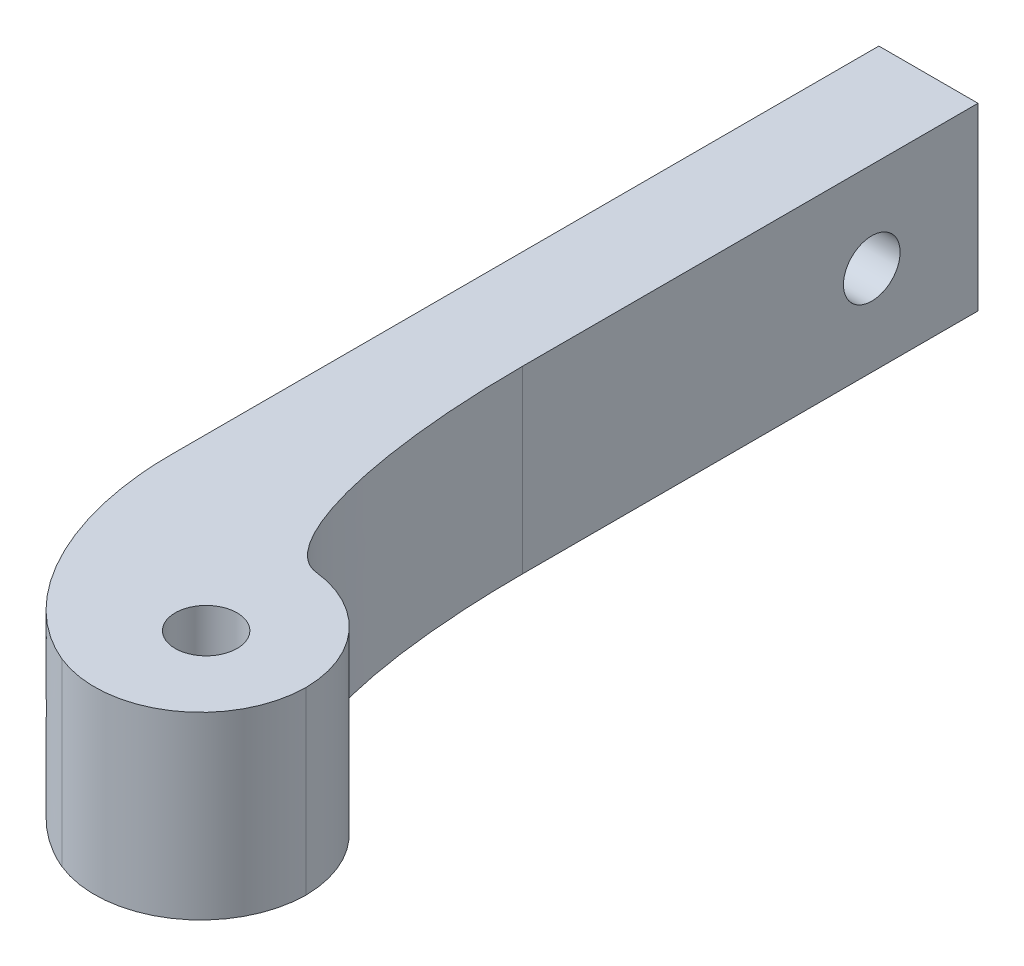
ISO-10303-21;
HEADER;
FILE_DESCRIPTION(('STEP AP214'),'2;1');
FILE_NAME('part.step','',(''),(''),'','','');
FILE_SCHEMA(('AUTOMOTIVE_DESIGN { 1 0 10303 214 1 1 1 1 }'));
ENDSEC;
DATA;
#1=APPLICATION_CONTEXT('core data for automotive mechanical design processes');
#2=APPLICATION_PROTOCOL_DEFINITION('international standard','automotive_design',2000,#1);
#3=PRODUCT_CONTEXT('',#1,'mechanical');
#4=PRODUCT('Part','Part','',(#3));
#5=PRODUCT_RELATED_PRODUCT_CATEGORY('part','',(#4));
#6=PRODUCT_DEFINITION_FORMATION('','',#4);
#7=PRODUCT_DEFINITION_CONTEXT('part definition',#1,'design');
#8=PRODUCT_DEFINITION('design','',#6,#7);
#9=PRODUCT_DEFINITION_SHAPE('','',#8);
#10=(LENGTH_UNIT() NAMED_UNIT(*) SI_UNIT(.MILLI.,.METRE.));
#11=(NAMED_UNIT(*) PLANE_ANGLE_UNIT() SI_UNIT($,.RADIAN.));
#12=(NAMED_UNIT(*) SI_UNIT($,.STERADIAN.) SOLID_ANGLE_UNIT());
#13=UNCERTAINTY_MEASURE_WITH_UNIT(LENGTH_MEASURE(1.E-05),#10,'distance_accuracy_value','');
#14=(GEOMETRIC_REPRESENTATION_CONTEXT(3) GLOBAL_UNCERTAINTY_ASSIGNED_CONTEXT((#13)) GLOBAL_UNIT_ASSIGNED_CONTEXT((#10,
#11,#12)) REPRESENTATION_CONTEXT('',''));
#15=CARTESIAN_POINT('',(0.,0.,0.));
#16=DIRECTION('',(0.,0.,1.));
#17=DIRECTION('',(1.,0.,0.));
#18=AXIS2_PLACEMENT_3D('',#15,#16,#17);
#19=CARTESIAN_POINT('',(-3.5,12.7,26.));
#20=DIRECTION('',(1.,0.,0.));
#21=DIRECTION('',(0.,0.,-1.));
#22=AXIS2_PLACEMENT_3D('',#19,#20,#21);
#23=PLANE('',#22);
#24=CARTESIAN_POINT('',(-3.5,6.35,-18.5));
#25=DIRECTION('',(-1.,0.,0.));
#26=DIRECTION('',(0.,0.,1.));
#27=AXIS2_PLACEMENT_3D('',#24,#25,#26);
#28=CIRCLE('',#27,2.);
#29=CARTESIAN_POINT('',(-3.5,6.35,-16.5));
#30=VERTEX_POINT('',#29);
#31=EDGE_CURVE('E532',#30,#30,#28,.T.);
#32=ORIENTED_EDGE('',*,*,#31,.F.);
#33=EDGE_LOOP('',(#32));
#34=FACE_BOUND('',#33,.T.);
#35=DIRECTION('',(0.,0.,1.));
#36=VECTOR('',#35,1.);
#37=CARTESIAN_POINT('',(-3.5,0.,26.));
#38=LINE('',#37,#36);
#39=CARTESIAN_POINT('',(-3.5,0.,-26.));
#40=VERTEX_POINT('',#39);
#41=CARTESIAN_POINT('',(-3.5,0.,24.));
#42=VERTEX_POINT('',#41);
#43=EDGE_CURVE('E158',#40,#42,#38,.T.);
#44=ORIENTED_EDGE('',*,*,#43,.T.);
#45=CARTESIAN_POINT('',(-3.5,13.335,24.));
#46=CARTESIAN_POINT('',(-3.5,8.67833333333333,24.));
#47=CARTESIAN_POINT('',(-3.5,4.02166666666666,24.));
#48=CARTESIAN_POINT('',(-3.5,-0.634999999999997,24.));
#49=(BOUNDED_CURVE() B_SPLINE_CURVE(3,(#45,#46,#47,#48),.UNSPECIFIED.,.F.,
.F.) B_SPLINE_CURVE_WITH_KNOTS((4,4),(-0.0416369433961698,-0.0276669433961698),
.UNSPECIFIED.) CURVE() GEOMETRIC_REPRESENTATION_ITEM() RATIONAL_B_SPLINE_CURVE((1.,1.,1.,1.)) REPRESENTATION_ITEM(''));
#50=CARTESIAN_POINT('',(-3.5,12.7,24.));
#51=VERTEX_POINT('',#50);
#52=EDGE_CURVE('E357',#42,#51,#49,.F.);
#53=ORIENTED_EDGE('',*,*,#52,.T.);
#54=DIRECTION('',(0.,0.,1.));
#55=VECTOR('',#54,1.);
#56=CARTESIAN_POINT('',(-3.5,12.7,26.));
#57=LINE('',#56,#55);
#58=CARTESIAN_POINT('',(-3.5,12.7,-26.));
#59=VERTEX_POINT('',#58);
#60=EDGE_CURVE('E129',#59,#51,#57,.T.);
#61=ORIENTED_EDGE('',*,*,#60,.F.);
#62=DIRECTION('',(0.,-1.,0.));
#63=VECTOR('',#62,1.);
#64=CARTESIAN_POINT('',(-3.5,12.7,-26.));
#65=LINE('',#64,#63);
#66=EDGE_CURVE('E139',#59,#40,#65,.T.);
#67=ORIENTED_EDGE('',*,*,#66,.T.);
#68=EDGE_LOOP('',(#44,#53,#61,#67));
#69=FACE_BOUND('',#68,.T.);
#70=ADVANCED_FACE('F49',(#34,#69),#23,.F.);
#71=CARTESIAN_POINT('',(3.5,12.7,26.));
#72=DIRECTION('',(-1.,0.,0.));
#73=DIRECTION('',(0.,0.,1.));
#74=AXIS2_PLACEMENT_3D('',#71,#72,#73);
#75=PLANE('',#74);
#76=CARTESIAN_POINT('',(3.5,6.35,-18.5));
#77=DIRECTION('',(-1.,0.,0.));
#78=DIRECTION('',(0.,0.,1.));
#79=AXIS2_PLACEMENT_3D('',#76,#77,#78);
#80=CIRCLE('',#79,2.);
#81=CARTESIAN_POINT('',(3.5,6.35,-16.5));
#82=VERTEX_POINT('',#81);
#83=EDGE_CURVE('E163',#82,#82,#80,.T.);
#84=ORIENTED_EDGE('',*,*,#83,.T.);
#85=EDGE_LOOP('',(#84));
#86=FACE_BOUND('',#85,.T.);
#87=DIRECTION('',(0.,0.,-1.));
#88=VECTOR('',#87,1.);
#89=CARTESIAN_POINT('',(3.5,12.7,26.));
#90=LINE('',#89,#88);
#91=CARTESIAN_POINT('',(3.5,12.7,6.16412613432671));
#92=VERTEX_POINT('',#91);
#93=CARTESIAN_POINT('',(3.5,12.7,-26.));
#94=VERTEX_POINT('',#93);
#95=EDGE_CURVE('E115',#92,#94,#90,.T.);
#96=ORIENTED_EDGE('',*,*,#95,.F.);
#97=CARTESIAN_POINT('',(3.5,-0.634999999999998,6.16412613432671));
#98=CARTESIAN_POINT('',(3.5,4.02166666666667,6.16412613432671));
#99=CARTESIAN_POINT('',(3.5,8.67833333333333,6.16412613432671));
#100=CARTESIAN_POINT('',(3.5,13.335,6.16412613432671));
#101=(BOUNDED_CURVE() B_SPLINE_CURVE(3,(#97,#98,#99,#100),.UNSPECIFIED.,.F.,
.F.) B_SPLINE_CURVE_WITH_KNOTS((4,4),(-0.000635,0.013335),
.UNSPECIFIED.) CURVE() GEOMETRIC_REPRESENTATION_ITEM() RATIONAL_B_SPLINE_CURVE((1.,1.,1.,1.)) REPRESENTATION_ITEM(''));
#102=CARTESIAN_POINT('',(3.5,0.,6.16412613432671));
#103=VERTEX_POINT('',#102);
#104=EDGE_CURVE('E382',#92,#103,#101,.F.);
#105=ORIENTED_EDGE('',*,*,#104,.T.);
#106=DIRECTION('',(0.,0.,-1.));
#107=VECTOR('',#106,1.);
#108=CARTESIAN_POINT('',(3.5,0.,26.));
#109=LINE('',#108,#107);
#110=CARTESIAN_POINT('',(3.5,0.,-26.));
#111=VERTEX_POINT('',#110);
#112=EDGE_CURVE('E134',#103,#111,#109,.T.);
#113=ORIENTED_EDGE('',*,*,#112,.T.);
#114=DIRECTION('',(0.,-1.,0.));
#115=VECTOR('',#114,1.);
#116=CARTESIAN_POINT('',(3.5,12.7,-26.));
#117=LINE('',#116,#115);
#118=EDGE_CURVE('E132',#94,#111,#117,.T.);
#119=ORIENTED_EDGE('',*,*,#118,.F.);
#120=EDGE_LOOP('',(#96,#105,#113,#119));
#121=FACE_BOUND('',#120,.T.);
#122=ADVANCED_FACE('F133',(#86,#121),#75,.F.);
#123=CARTESIAN_POINT('',(3.5,12.7,-26.));
#124=DIRECTION('',(0.,0.,1.));
#125=DIRECTION('',(1.,0.,0.));
#126=AXIS2_PLACEMENT_3D('',#123,#124,#125);
#127=PLANE('',#126);
#128=DIRECTION('',(-1.,0.,0.));
#129=VECTOR('',#128,1.);
#130=CARTESIAN_POINT('',(3.5,0.,-26.));
#131=LINE('',#130,#129);
#132=EDGE_CURVE('E373',#111,#40,#131,.T.);
#133=ORIENTED_EDGE('',*,*,#132,.T.);
#134=ORIENTED_EDGE('',*,*,#66,.F.);
#135=DIRECTION('',(-1.,0.,0.));
#136=VECTOR('',#135,1.);
#137=CARTESIAN_POINT('',(3.5,12.7,-26.));
#138=LINE('',#137,#136);
#139=EDGE_CURVE('E121',#94,#59,#138,.T.);
#140=ORIENTED_EDGE('',*,*,#139,.F.);
#141=ORIENTED_EDGE('',*,*,#118,.T.);
#142=EDGE_LOOP('',(#133,#134,#140,#141));
#143=FACE_BOUND('',#142,.T.);
#144=ADVANCED_FACE('F141',(#143),#127,.F.);
#145=CARTESIAN_POINT('',(0.,12.7,0.));
#146=DIRECTION('',(0.,1.,0.));
#147=DIRECTION('',(0.,0.,1.));
#148=AXIS2_PLACEMENT_3D('',#145,#146,#147);
#149=PLANE('',#148);
#150=CARTESIAN_POINT('',(8.,12.7,33.3867112101809));
#151=DIRECTION('',(0.,1.,0.));
#152=DIRECTION('',(0.,0.,1.));
#153=AXIS2_PLACEMENT_3D('',#150,#151,#152);
#154=CIRCLE('',#153,7.5);
#155=CARTESIAN_POINT('',(5.11946494128914,12.7,40.3144846845481));
#156=VERTEX_POINT('',#155);
#157=CARTESIAN_POINT('',(15.4997860911179,12.7,33.4433556050903));
#158=VERTEX_POINT('',#157);
#159=EDGE_CURVE('E298',#156,#158,#154,.T.);
#160=ORIENTED_EDGE('',*,*,#159,.T.);
#161=CARTESIAN_POINT('',(8.,12.7,33.5));
#162=DIRECTION('',(0.,1.,0.));
#163=DIRECTION('',(0.,0.,1.));
#164=AXIS2_PLACEMENT_3D('',#161,#162,#163);
#165=CIRCLE('',#164,7.5);
#166=CARTESIAN_POINT('',(8.81818181818182,12.7,26.0447616729982));
#167=VERTEX_POINT('',#166);
#168=EDGE_CURVE('E284',#158,#167,#165,.T.);
#169=ORIENTED_EDGE('',*,*,#168,.T.);
#170=CARTESIAN_POINT('',(3.5,12.7,6.16412613432671));
#171=CARTESIAN_POINT('',(3.50000000000001,12.7,25.4611130384989));
#172=CARTESIAN_POINT('',(8.81818181818182,12.7,26.0447616729982));
#173=(BOUNDED_CURVE() B_SPLINE_CURVE(2,(#170,#171,#172),.UNSPECIFIED.,.F.,
.F.) B_SPLINE_CURVE_WITH_KNOTS((3,3),(0.,1.),
.UNSPECIFIED.) CURVE() GEOMETRIC_REPRESENTATION_ITEM() RATIONAL_B_SPLINE_CURVE((1.,
0.744678087864451,1.)) REPRESENTATION_ITEM(''));
#174=EDGE_CURVE('E12',#167,#92,#173,.F.);
#175=ORIENTED_EDGE('',*,*,#174,.T.);
#176=ORIENTED_EDGE('',*,*,#95,.T.);
#177=ORIENTED_EDGE('',*,*,#139,.T.);
#178=ORIENTED_EDGE('',*,*,#60,.T.);
#179=CARTESIAN_POINT('',(8.5,12.7,41.));
#180=CARTESIAN_POINT('',(-3.5,12.7,41.));
#181=CARTESIAN_POINT('',(-3.5,12.7,24.));
#182=(BOUNDED_CURVE() B_SPLINE_CURVE(2,(#179,#180,#181),.UNSPECIFIED.,.F.,
.F.) B_SPLINE_CURVE_WITH_KNOTS((3,3),(0.,1.),
.UNSPECIFIED.) CURVE() GEOMETRIC_REPRESENTATION_ITEM() RATIONAL_B_SPLINE_CURVE((1.,
0.707106781186547,1.)) REPRESENTATION_ITEM(''));
#183=EDGE_CURVE('E256',#51,#156,#182,.F.);
#184=ORIENTED_EDGE('',*,*,#183,.T.);
#185=EDGE_LOOP('',(#160,#169,#175,#176,#177,#178,#184));
#186=FACE_BOUND('',#185,.T.);
#187=CARTESIAN_POINT('',(8.5,12.7,33.5));
#188=DIRECTION('',(0.,1.,0.));
#189=DIRECTION('',(0.,0.,1.));
#190=AXIS2_PLACEMENT_3D('',#187,#188,#189);
#191=CIRCLE('',#190,2.1844);
#192=CARTESIAN_POINT('',(8.5,12.7,35.6844));
#193=VERTEX_POINT('',#192);
#194=EDGE_CURVE('E538',#193,#193,#191,.T.);
#195=ORIENTED_EDGE('',*,*,#194,.F.);
#196=EDGE_LOOP('',(#195));
#197=FACE_BOUND('',#196,.T.);
#198=ADVANCED_FACE('F117',(#186,#197),#149,.T.);
#199=CARTESIAN_POINT('',(0.,0.,0.));
#200=DIRECTION('',(0.,1.,0.));
#201=DIRECTION('',(0.,0.,1.));
#202=AXIS2_PLACEMENT_3D('',#199,#200,#201);
#203=PLANE('',#202);
#204=CARTESIAN_POINT('',(8.5,0.,33.5));
#205=DIRECTION('',(0.,1.,0.));
#206=DIRECTION('',(0.,0.,1.));
#207=AXIS2_PLACEMENT_3D('',#204,#205,#206);
#208=CIRCLE('',#207,2.1844);
#209=CARTESIAN_POINT('',(8.5,0.,35.6844));
#210=VERTEX_POINT('',#209);
#211=EDGE_CURVE('E543',#210,#210,#208,.T.);
#212=ORIENTED_EDGE('',*,*,#211,.T.);
#213=EDGE_LOOP('',(#212));
#214=FACE_BOUND('',#213,.T.);
#215=ORIENTED_EDGE('',*,*,#112,.F.);
#216=CARTESIAN_POINT('',(8.81818181818182,0.,26.0447616729982));
#217=CARTESIAN_POINT('',(3.50000000000001,0.,25.4611130384989));
#218=CARTESIAN_POINT('',(3.5,0.,6.16412613432671));
#219=(BOUNDED_CURVE() B_SPLINE_CURVE(2,(#216,#217,#218),.UNSPECIFIED.,.F.,
.F.) B_SPLINE_CURVE_WITH_KNOTS((3,3),(0.,1.),
.UNSPECIFIED.) CURVE() GEOMETRIC_REPRESENTATION_ITEM() RATIONAL_B_SPLINE_CURVE((1.,
0.744678087864451,1.)) REPRESENTATION_ITEM(''));
#220=CARTESIAN_POINT('',(8.81818181818182,0.,26.0447616729982));
#221=VERTEX_POINT('',#220);
#222=EDGE_CURVE('E64',#103,#221,#219,.F.);
#223=ORIENTED_EDGE('',*,*,#222,.T.);
#224=CARTESIAN_POINT('',(8.,0.,33.5));
#225=DIRECTION('',(0.,1.,0.));
#226=DIRECTION('',(0.,0.,1.));
#227=AXIS2_PLACEMENT_3D('',#224,#225,#226);
#228=CIRCLE('',#227,7.5);
#229=CARTESIAN_POINT('',(15.4997860911179,0.,33.4433556050903));
#230=VERTEX_POINT('',#229);
#231=EDGE_CURVE('E283',#221,#230,#228,.F.);
#232=ORIENTED_EDGE('',*,*,#231,.T.);
#233=CARTESIAN_POINT('',(8.,0.,33.3867112101809));
#234=DIRECTION('',(0.,1.,0.));
#235=DIRECTION('',(0.,0.,1.));
#236=AXIS2_PLACEMENT_3D('',#233,#234,#235);
#237=CIRCLE('',#236,7.5);
#238=CARTESIAN_POINT('',(5.11950638311245,0.,40.3143862532067));
#239=VERTEX_POINT('',#238);
#240=EDGE_CURVE('E280',#230,#239,#237,.F.);
#241=ORIENTED_EDGE('',*,*,#240,.T.);
#242=CARTESIAN_POINT('',(-3.5,0.,24.));
#243=CARTESIAN_POINT('',(-3.50000000000001,0.,41.));
#244=CARTESIAN_POINT('',(8.5,0.,41.));
#245=(BOUNDED_CURVE() B_SPLINE_CURVE(2,(#242,#243,#244),.UNSPECIFIED.,.F.,
.F.) B_SPLINE_CURVE_WITH_KNOTS((3,3),(0.,1.),
.UNSPECIFIED.) CURVE() GEOMETRIC_REPRESENTATION_ITEM() RATIONAL_B_SPLINE_CURVE((1.,
0.707106781186547,1.)) REPRESENTATION_ITEM(''));
#246=EDGE_CURVE('E138',#239,#42,#245,.F.);
#247=ORIENTED_EDGE('',*,*,#246,.T.);
#248=ORIENTED_EDGE('',*,*,#43,.F.);
#249=ORIENTED_EDGE('',*,*,#132,.F.);
#250=EDGE_LOOP('',(#215,#223,#232,#241,#247,#248,#249));
#251=FACE_BOUND('',#250,.T.);
#252=ADVANCED_FACE('F171',(#214,#251),#203,.F.);
#253=CARTESIAN_POINT('',(6.5,6.35,-18.5));
#254=DIRECTION('',(-1.,0.,0.));
#255=DIRECTION('',(0.,0.,1.));
#256=AXIS2_PLACEMENT_3D('',#253,#254,#255);
#257=CYLINDRICAL_SURFACE('',#256,2.);
#258=ORIENTED_EDGE('',*,*,#31,.T.);
#259=EDGE_LOOP('',(#258));
#260=FACE_BOUND('',#259,.T.);
#261=ORIENTED_EDGE('',*,*,#83,.F.);
#262=EDGE_LOOP('',(#261));
#263=FACE_BOUND('',#262,.T.);
#264=ADVANCED_FACE('F181',(#260,#263),#257,.F.);
#265=CARTESIAN_POINT('',(8.5,0.,33.5));
#266=DIRECTION('',(0.,1.,0.));
#267=DIRECTION('',(0.,0.,1.));
#268=AXIS2_PLACEMENT_3D('',#265,#266,#267);
#269=CYLINDRICAL_SURFACE('',#268,2.1844);
#270=ORIENTED_EDGE('',*,*,#194,.T.);
#271=EDGE_LOOP('',(#270));
#272=FACE_BOUND('',#271,.T.);
#273=ORIENTED_EDGE('',*,*,#211,.F.);
#274=EDGE_LOOP('',(#273));
#275=FACE_BOUND('',#274,.T.);
#276=ADVANCED_FACE('F232',(#272,#275),#269,.F.);
#277=CARTESIAN_POINT('',(-3.5,-0.634999999999997,24.));
#278=CARTESIAN_POINT('',(-3.5,4.02166666666666,24.));
#279=CARTESIAN_POINT('',(-3.5,8.67833333333333,24.));
#280=CARTESIAN_POINT('',(-3.5,13.335,24.));
#281=CARTESIAN_POINT('',(-3.5,-0.634999999999997,41.));
#282=CARTESIAN_POINT('',(-3.5,4.02166666666666,41.));
#283=CARTESIAN_POINT('',(-3.5,8.67833333333333,41.));
#284=CARTESIAN_POINT('',(-3.5,13.335,41.));
#285=CARTESIAN_POINT('',(8.5,-0.634999999999997,41.));
#286=CARTESIAN_POINT('',(8.5,4.02166666666666,41.));
#287=CARTESIAN_POINT('',(8.5,8.67833333333333,41.));
#288=CARTESIAN_POINT('',(8.5,13.335,41.));
#289=(BOUNDED_SURFACE() B_SPLINE_SURFACE(2,3,((#277,#278,#279,#280),(#281,#282,#283,#284),(#285,
#286,#287,#288)),.UNSPECIFIED.,.F.,.F.,.F.) B_SPLINE_SURFACE_WITH_KNOTS((3,3),(4,4),(0.,1.),
(-0.0416369433961698,-0.0276669433961698),
.UNSPECIFIED.) GEOMETRIC_REPRESENTATION_ITEM() RATIONAL_B_SPLINE_SURFACE(((1.,1.,1.,1.),
(0.707106781186547,0.707106781186547,0.707106781186547,0.707106781186547),(1.,1.,1.,1.))) REPRESENTATION_ITEM('') SURFACE());
#290=DIRECTION('',(0.,1.,0.));
#291=VECTOR('',#290,1.);
#292=CARTESIAN_POINT('',(5.12054258210433,0.,40.3119350317281));
#293=LINE('',#292,#291);
#294=EDGE_CURVE('E289',#239,#156,#293,.T.);
#295=ORIENTED_EDGE('',*,*,#246,.F.);
#296=ORIENTED_EDGE('',*,*,#294,.T.);
#297=ORIENTED_EDGE('',*,*,#183,.F.);
#298=ORIENTED_EDGE('',*,*,#52,.F.);
#299=EDGE_LOOP('',(#295,#296,#297,#298));
#300=FACE_BOUND('',#299,.T.);
#301=ADVANCED_FACE('F222',(#300),#289,.T.);
#302=CARTESIAN_POINT('',(8.,6.35,33.3867112101809));
#303=DIRECTION('',(0.,1.,0.));
#304=DIRECTION('',(0.,0.,1.));
#305=AXIS2_PLACEMENT_3D('',#302,#303,#304);
#306=CYLINDRICAL_SURFACE('',#305,7.5);
#307=ORIENTED_EDGE('',*,*,#294,.F.);
#308=ORIENTED_EDGE('',*,*,#240,.F.);
#309=DIRECTION('',(0.,1.,0.));
#310=VECTOR('',#309,1.);
#311=CARTESIAN_POINT('',(15.4997860911179,6.35,33.4433556050903));
#312=LINE('',#311,#310);
#313=EDGE_CURVE('E381',#158,#230,#312,.F.);
#314=ORIENTED_EDGE('',*,*,#313,.F.);
#315=ORIENTED_EDGE('',*,*,#159,.F.);
#316=EDGE_LOOP('',(#307,#308,#314,#315));
#317=FACE_BOUND('',#316,.T.);
#318=ADVANCED_FACE('F220',(#317),#306,.T.);
#319=CARTESIAN_POINT('',(8.,-0.0850000000000017,33.5));
#320=DIRECTION('',(0.,-1.,0.));
#321=DIRECTION('',(0.,0.,-1.));
#322=AXIS2_PLACEMENT_3D('',#319,#320,#321);
#323=CYLINDRICAL_SURFACE('',#322,7.5);
#324=ORIENTED_EDGE('',*,*,#231,.F.);
#325=CARTESIAN_POINT('',(8.81818181818182,13.335,26.0447616729982));
#326=CARTESIAN_POINT('',(8.81818181818182,8.67833333333333,26.0447616729982));
#327=CARTESIAN_POINT('',(8.81818181818182,4.02166666666667,26.0447616729982));
#328=CARTESIAN_POINT('',(8.81818181818182,-0.634999999999998,26.0447616729982));
#329=(BOUNDED_CURVE() B_SPLINE_CURVE(3,(#325,#326,#327,#328),.UNSPECIFIED.,.F.,
.F.) B_SPLINE_CURVE_WITH_KNOTS((4,4),(-0.000635,0.013335),
.UNSPECIFIED.) CURVE() GEOMETRIC_REPRESENTATION_ITEM() RATIONAL_B_SPLINE_CURVE((1.,1.,1.,1.)) REPRESENTATION_ITEM(''));
#330=EDGE_CURVE('E71',#221,#167,#329,.F.);
#331=ORIENTED_EDGE('',*,*,#330,.T.);
#332=ORIENTED_EDGE('',*,*,#168,.F.);
#333=ORIENTED_EDGE('',*,*,#313,.T.);
#334=EDGE_LOOP('',(#324,#331,#332,#333));
#335=FACE_BOUND('',#334,.T.);
#336=ADVANCED_FACE('F211',(#335),#323,.T.);
#337=CARTESIAN_POINT('',(3.5,13.335,6.16412613432671));
#338=CARTESIAN_POINT('',(3.5,8.67833333333333,6.16412613432671));
#339=CARTESIAN_POINT('',(3.5,4.02166666666667,6.16412613432671));
#340=CARTESIAN_POINT('',(3.5,-0.634999999999998,6.16412613432671));
#341=CARTESIAN_POINT('',(3.50000000000001,13.335,25.4611130384989));
#342=CARTESIAN_POINT('',(3.50000000000001,8.67833333333333,25.4611130384989));
#343=CARTESIAN_POINT('',(3.50000000000001,4.02166666666667,25.4611130384989));
#344=CARTESIAN_POINT('',(3.50000000000001,-0.634999999999998,25.4611130384989));
#345=CARTESIAN_POINT('',(8.81818181818182,13.335,26.0447616729982));
#346=CARTESIAN_POINT('',(8.81818181818182,8.67833333333333,26.0447616729982));
#347=CARTESIAN_POINT('',(8.81818181818182,4.02166666666667,26.0447616729982));
#348=CARTESIAN_POINT('',(8.81818181818182,-0.634999999999998,26.0447616729982));
#349=(BOUNDED_SURFACE() B_SPLINE_SURFACE(2,3,((#337,#338,#339,#340),(#341,#342,#343,#344),(#345,
#346,#347,#348)),.UNSPECIFIED.,.F.,.F.,.F.) B_SPLINE_SURFACE_WITH_KNOTS((3,3),(4,4),(0.,1.),
(-0.000635,0.013335),
.UNSPECIFIED.) GEOMETRIC_REPRESENTATION_ITEM() RATIONAL_B_SPLINE_SURFACE(((1.,1.,1.,1.),
(0.744678087864451,0.744678087864451,0.744678087864451,0.744678087864451),(1.,1.,1.,1.))) REPRESENTATION_ITEM('') SURFACE());
#350=ORIENTED_EDGE('',*,*,#174,.F.);
#351=ORIENTED_EDGE('',*,*,#330,.F.);
#352=ORIENTED_EDGE('',*,*,#222,.F.);
#353=ORIENTED_EDGE('',*,*,#104,.F.);
#354=EDGE_LOOP('',(#350,#351,#352,#353));
#355=FACE_BOUND('',#354,.T.);
#356=ADVANCED_FACE('F52',(#355),#349,.T.);
#357=CLOSED_SHELL('',(#70,#122,#144,#198,#252,#264,#276,#301,#318,#336,#356));
#358=MANIFOLD_SOLID_BREP('B2',#357);
#359=ADVANCED_BREP_SHAPE_REPRESENTATION('',(#18,#358),#14);
#360=SHAPE_DEFINITION_REPRESENTATION(#9,#359);
ENDSEC;
END-ISO-10303-21;
